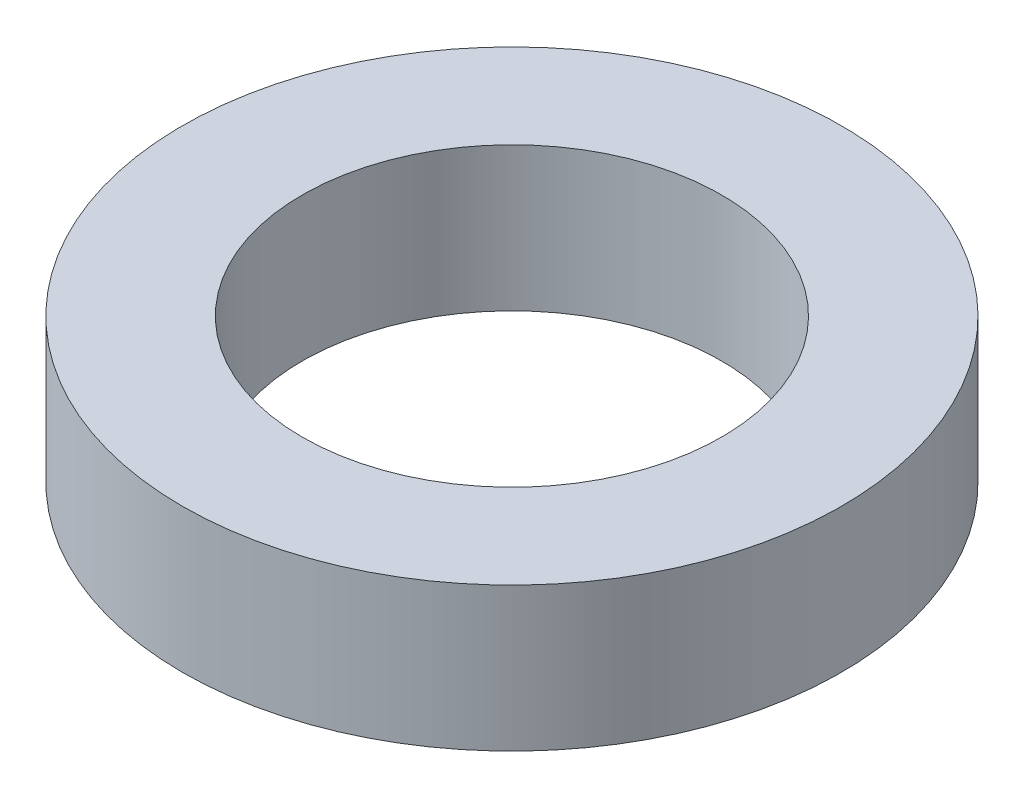
ISO-10303-21;
HEADER;
FILE_DESCRIPTION(('STEP AP214'),'2;1');
FILE_NAME('part.step','',(''),(''),'','','');
FILE_SCHEMA(('AUTOMOTIVE_DESIGN { 1 0 10303 214 1 1 1 1 }'));
ENDSEC;
DATA;
#1=APPLICATION_CONTEXT('core data for automotive mechanical design processes');
#2=APPLICATION_PROTOCOL_DEFINITION('international standard','automotive_design',2000,#1);
#3=PRODUCT_CONTEXT('',#1,'mechanical');
#4=PRODUCT('Part','Part','',(#3));
#5=PRODUCT_RELATED_PRODUCT_CATEGORY('part','',(#4));
#6=PRODUCT_DEFINITION_FORMATION('','',#4);
#7=PRODUCT_DEFINITION_CONTEXT('part definition',#1,'design');
#8=PRODUCT_DEFINITION('design','',#6,#7);
#9=PRODUCT_DEFINITION_SHAPE('','',#8);
#10=(LENGTH_UNIT() NAMED_UNIT(*) SI_UNIT(.MILLI.,.METRE.));
#11=(NAMED_UNIT(*) PLANE_ANGLE_UNIT() SI_UNIT($,.RADIAN.));
#12=(NAMED_UNIT(*) SI_UNIT($,.STERADIAN.) SOLID_ANGLE_UNIT());
#13=UNCERTAINTY_MEASURE_WITH_UNIT(LENGTH_MEASURE(1.E-05),#10,'distance_accuracy_value','');
#14=(GEOMETRIC_REPRESENTATION_CONTEXT(3) GLOBAL_UNCERTAINTY_ASSIGNED_CONTEXT((#13)) GLOBAL_UNIT_ASSIGNED_CONTEXT((#10,
#11,#12)) REPRESENTATION_CONTEXT('',''));
#15=CARTESIAN_POINT('',(0.,0.,0.));
#16=DIRECTION('',(0.,0.,1.));
#17=DIRECTION('',(1.,0.,0.));
#18=AXIS2_PLACEMENT_3D('',#15,#16,#17);
#19=CARTESIAN_POINT('',(0.,12.,0.));
#20=DIRECTION('',(0.,-1.,0.));
#21=DIRECTION('',(0.,0.,-1.));
#22=AXIS2_PLACEMENT_3D('',#19,#20,#21);
#23=CYLINDRICAL_SURFACE('',#22,27.5);
#24=CARTESIAN_POINT('',(0.,12.,0.));
#25=DIRECTION('',(0.,1.,0.));
#26=DIRECTION('',(0.,0.,1.));
#27=AXIS2_PLACEMENT_3D('',#24,#25,#26);
#28=CIRCLE('',#27,27.5);
#29=CARTESIAN_POINT('',(0.,12.,27.5));
#30=VERTEX_POINT('',#29);
#31=EDGE_CURVE('E10',#30,#30,#28,.T.);
#32=ORIENTED_EDGE('',*,*,#31,.F.);
#33=EDGE_LOOP('',(#32));
#34=FACE_BOUND('',#33,.T.);
#35=CARTESIAN_POINT('',(0.,0.,0.));
#36=DIRECTION('',(0.,1.,0.));
#37=DIRECTION('',(0.,0.,1.));
#38=AXIS2_PLACEMENT_3D('',#35,#36,#37);
#39=CIRCLE('',#38,27.5);
#40=CARTESIAN_POINT('',(0.,0.,27.5));
#41=VERTEX_POINT('',#40);
#42=EDGE_CURVE('E37',#41,#41,#39,.T.);
#43=ORIENTED_EDGE('',*,*,#42,.T.);
#44=EDGE_LOOP('',(#43));
#45=FACE_BOUND('',#44,.T.);
#46=ADVANCED_FACE('F40',(#34,#45),#23,.T.);
#47=CARTESIAN_POINT('',(0.,12.,0.));
#48=DIRECTION('',(0.,1.,0.));
#49=DIRECTION('',(0.,0.,1.));
#50=AXIS2_PLACEMENT_3D('',#47,#48,#49);
#51=PLANE('',#50);
#52=CARTESIAN_POINT('',(0.,12.,0.));
#53=DIRECTION('',(0.,1.,0.));
#54=DIRECTION('',(0.,0.,1.));
#55=AXIS2_PLACEMENT_3D('',#52,#53,#54);
#56=CIRCLE('',#55,17.5);
#57=CARTESIAN_POINT('',(0.,12.,17.5));
#58=VERTEX_POINT('',#57);
#59=EDGE_CURVE('E50',#58,#58,#56,.T.);
#60=ORIENTED_EDGE('',*,*,#59,.F.);
#61=EDGE_LOOP('',(#60));
#62=FACE_BOUND('',#61,.T.);
#63=ORIENTED_EDGE('',*,*,#31,.T.);
#64=EDGE_LOOP('',(#63));
#65=FACE_BOUND('',#64,.T.);
#66=ADVANCED_FACE('F59',(#62,#65),#51,.T.);
#67=CARTESIAN_POINT('',(0.,0.,0.));
#68=DIRECTION('',(0.,1.,0.));
#69=DIRECTION('',(0.,0.,1.));
#70=AXIS2_PLACEMENT_3D('',#67,#68,#69);
#71=PLANE('',#70);
#72=CARTESIAN_POINT('',(0.,0.,0.));
#73=DIRECTION('',(0.,1.,0.));
#74=DIRECTION('',(0.,0.,1.));
#75=AXIS2_PLACEMENT_3D('',#72,#73,#74);
#76=CIRCLE('',#75,17.5);
#77=CARTESIAN_POINT('',(0.,0.,17.5));
#78=VERTEX_POINT('',#77);
#79=EDGE_CURVE('E47',#78,#78,#76,.T.);
#80=ORIENTED_EDGE('',*,*,#79,.T.);
#81=EDGE_LOOP('',(#80));
#82=FACE_BOUND('',#81,.T.);
#83=ORIENTED_EDGE('',*,*,#42,.F.);
#84=EDGE_LOOP('',(#83));
#85=FACE_BOUND('',#84,.T.);
#86=ADVANCED_FACE('F58',(#82,#85),#71,.F.);
#87=CARTESIAN_POINT('',(0.,12.,0.));
#88=DIRECTION('',(0.,-1.,0.));
#89=DIRECTION('',(0.,0.,-1.));
#90=AXIS2_PLACEMENT_3D('',#87,#88,#89);
#91=CYLINDRICAL_SURFACE('',#90,17.5);
#92=ORIENTED_EDGE('',*,*,#59,.T.);
#93=EDGE_LOOP('',(#92));
#94=FACE_BOUND('',#93,.T.);
#95=ORIENTED_EDGE('',*,*,#79,.F.);
#96=EDGE_LOOP('',(#95));
#97=FACE_BOUND('',#96,.T.);
#98=ADVANCED_FACE('F54',(#94,#97),#91,.F.);
#99=CLOSED_SHELL('',(#46,#66,#86,#98));
#100=MANIFOLD_SOLID_BREP('B2',#99);
#101=ADVANCED_BREP_SHAPE_REPRESENTATION('',(#18,#100),#14);
#102=SHAPE_DEFINITION_REPRESENTATION(#9,#101);
ENDSEC;
END-ISO-10303-21;
